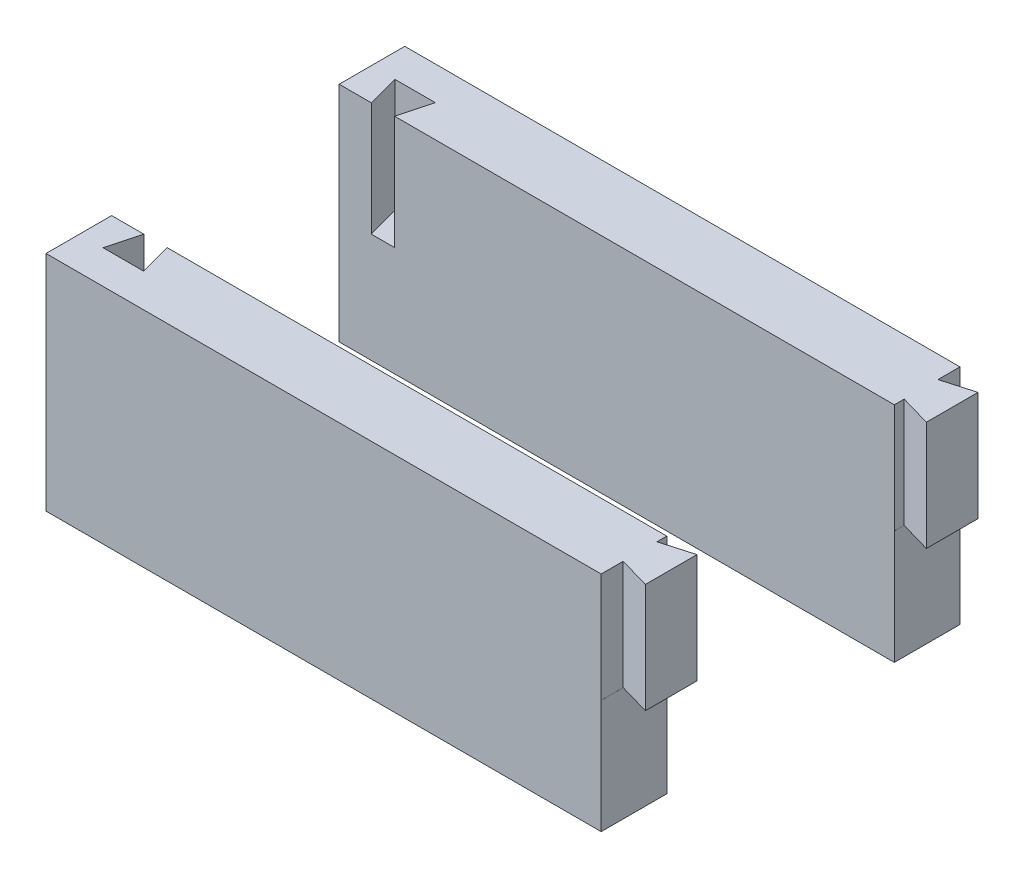
ISO-10303-21;
HEADER;
FILE_DESCRIPTION(('STEP AP214'),'2;1');
FILE_NAME('part.step','',(''),(''),'','','');
FILE_SCHEMA(('AUTOMOTIVE_DESIGN { 1 0 10303 214 1 1 1 1 }'));
ENDSEC;
DATA;
#1=APPLICATION_CONTEXT('core data for automotive mechanical design processes');
#2=APPLICATION_PROTOCOL_DEFINITION('international standard','automotive_design',2000,#1);
#3=PRODUCT_CONTEXT('',#1,'mechanical');
#4=PRODUCT('Part','Part','',(#3));
#5=PRODUCT_RELATED_PRODUCT_CATEGORY('part','',(#4));
#6=PRODUCT_DEFINITION_FORMATION('','',#4);
#7=PRODUCT_DEFINITION_CONTEXT('part definition',#1,'design');
#8=PRODUCT_DEFINITION('design','',#6,#7);
#9=PRODUCT_DEFINITION_SHAPE('','',#8);
#10=(LENGTH_UNIT() NAMED_UNIT(*) SI_UNIT(.MILLI.,.METRE.));
#11=(NAMED_UNIT(*) PLANE_ANGLE_UNIT() SI_UNIT($,.RADIAN.));
#12=(NAMED_UNIT(*) SI_UNIT($,.STERADIAN.) SOLID_ANGLE_UNIT());
#13=UNCERTAINTY_MEASURE_WITH_UNIT(LENGTH_MEASURE(1.E-05),#10,'distance_accuracy_value','');
#14=(GEOMETRIC_REPRESENTATION_CONTEXT(3) GLOBAL_UNCERTAINTY_ASSIGNED_CONTEXT((#13)) GLOBAL_UNIT_ASSIGNED_CONTEXT((#10,
#11,#12)) REPRESENTATION_CONTEXT('',''));
#15=CARTESIAN_POINT('',(0.,0.,0.));
#16=DIRECTION('',(0.,0.,1.));
#17=DIRECTION('',(1.,0.,0.));
#18=AXIS2_PLACEMENT_3D('',#15,#16,#17);
#19=CARTESIAN_POINT('',(-60.9366197183099,28.612676056338,-67.));
#20=DIRECTION('',(1.,0.,0.));
#21=DIRECTION('',(0.,0.,1.));
#22=AXIS2_PLACEMENT_3D('',#19,#20,#21);
#23=PLANE('',#22);
#24=DIRECTION('',(0.,-1.,0.));
#25=VECTOR('',#24,1.);
#26=CARTESIAN_POINT('',(-60.9366197183099,28.612676056338,-52.));
#27=LINE('',#26,#25);
#28=CARTESIAN_POINT('',(-60.9366197183099,28.612676056338,-52.));
#29=VERTEX_POINT('',#28);
#30=CARTESIAN_POINT('',(-60.9366197183099,-22.387323943662,-52.));
#31=VERTEX_POINT('',#30);
#32=EDGE_CURVE('E283',#29,#31,#27,.T.);
#33=ORIENTED_EDGE('',*,*,#32,.F.);
#34=DIRECTION('',(0.,0.,1.));
#35=VECTOR('',#34,1.);
#36=CARTESIAN_POINT('',(-60.9366197183099,28.612676056338,-67.));
#37=LINE('',#36,#35);
#38=CARTESIAN_POINT('',(-60.9366197183099,28.612676056338,-67.));
#39=VERTEX_POINT('',#38);
#40=EDGE_CURVE('E299',#39,#29,#37,.T.);
#41=ORIENTED_EDGE('',*,*,#40,.F.);
#42=DIRECTION('',(0.,-1.,0.));
#43=VECTOR('',#42,1.);
#44=CARTESIAN_POINT('',(-60.9366197183099,28.612676056338,-67.));
#45=LINE('',#44,#43);
#46=CARTESIAN_POINT('',(-60.9366197183099,-22.387323943662,-67.));
#47=VERTEX_POINT('',#46);
#48=EDGE_CURVE('E287',#39,#47,#45,.T.);
#49=ORIENTED_EDGE('',*,*,#48,.T.);
#50=DIRECTION('',(0.,0.,1.));
#51=VECTOR('',#50,1.);
#52=CARTESIAN_POINT('',(-60.9366197183099,-22.387323943662,-67.));
#53=LINE('',#52,#51);
#54=EDGE_CURVE('E12',#47,#31,#53,.T.);
#55=ORIENTED_EDGE('',*,*,#54,.T.);
#56=EDGE_LOOP('',(#33,#41,#49,#55));
#57=FACE_BOUND('',#56,.T.);
#58=ADVANCED_FACE('F54',(#57),#23,.F.);
#59=CARTESIAN_POINT('',(-60.9366197183099,-22.387323943662,-67.));
#60=DIRECTION('',(0.,1.,0.));
#61=DIRECTION('',(0.,0.,-1.));
#62=AXIS2_PLACEMENT_3D('',#59,#60,#61);
#63=PLANE('',#62);
#64=DIRECTION('',(1.,0.,0.));
#65=VECTOR('',#64,1.);
#66=CARTESIAN_POINT('',(-60.9366197183099,-22.387323943662,-52.));
#67=LINE('',#66,#65);
#68=CARTESIAN_POINT('',(65.9533802816901,-22.387323943662,-52.));
#69=VERTEX_POINT('',#68);
#70=EDGE_CURVE('E179',#31,#69,#67,.T.);
#71=ORIENTED_EDGE('',*,*,#70,.F.);
#72=ORIENTED_EDGE('',*,*,#54,.F.);
#73=DIRECTION('',(1.,0.,0.));
#74=VECTOR('',#73,1.);
#75=CARTESIAN_POINT('',(-60.9366197183099,-22.387323943662,-67.));
#76=LINE('',#75,#74);
#77=CARTESIAN_POINT('',(65.9533802816901,-22.387323943662,-67.));
#78=VERTEX_POINT('',#77);
#79=EDGE_CURVE('E291',#47,#78,#76,.T.);
#80=ORIENTED_EDGE('',*,*,#79,.T.);
#81=DIRECTION('',(0.,0.,1.));
#82=VECTOR('',#81,1.);
#83=CARTESIAN_POINT('',(65.9533802816901,-22.387323943662,-52.));
#84=LINE('',#83,#82);
#85=EDGE_CURVE('E170',#78,#69,#84,.T.);
#86=ORIENTED_EDGE('',*,*,#85,.T.);
#87=EDGE_LOOP('',(#71,#72,#80,#86));
#88=FACE_BOUND('',#87,.T.);
#89=ADVANCED_FACE('F359',(#88),#63,.F.);
#90=CARTESIAN_POINT('',(73.0633802816902,28.612676056338,-67.));
#91=DIRECTION('',(-1.,0.,0.));
#92=DIRECTION('',(0.,0.,-1.));
#93=AXIS2_PLACEMENT_3D('',#90,#91,#92);
#94=PLANE('',#93);
#95=DIRECTION('',(0.,1.,0.));
#96=VECTOR('',#95,1.);
#97=CARTESIAN_POINT('',(73.0633802816902,3.61267605633802,-64.0102835669542));
#98=LINE('',#97,#96);
#99=CARTESIAN_POINT('',(73.0633802816902,3.61267605633802,-64.0102835669542));
#100=VERTEX_POINT('',#99);
#101=CARTESIAN_POINT('',(73.0633802816902,28.612676056338,-64.0102835669542));
#102=VERTEX_POINT('',#101);
#103=EDGE_CURVE('E215',#100,#102,#98,.T.);
#104=ORIENTED_EDGE('',*,*,#103,.T.);
#105=DIRECTION('',(0.,0.,1.));
#106=VECTOR('',#105,1.);
#107=CARTESIAN_POINT('',(73.0633802816902,28.612676056338,-67.));
#108=LINE('',#107,#106);
#109=CARTESIAN_POINT('',(73.0633802816902,28.612676056338,-52.2102835669542));
#110=VERTEX_POINT('',#109);
#111=EDGE_CURVE('E62',#102,#110,#108,.T.);
#112=ORIENTED_EDGE('',*,*,#111,.T.);
#113=DIRECTION('',(0.,1.,0.));
#114=VECTOR('',#113,1.);
#115=CARTESIAN_POINT('',(73.0633802816902,3.61267605633802,-52.2102835669542));
#116=LINE('',#115,#114);
#117=CARTESIAN_POINT('',(73.0633802816902,3.61267605633802,-52.2102835669542));
#118=VERTEX_POINT('',#117);
#119=EDGE_CURVE('E194',#118,#110,#116,.T.);
#120=ORIENTED_EDGE('',*,*,#119,.F.);
#121=DIRECTION('',(0.,0.,-1.));
#122=VECTOR('',#121,1.);
#123=CARTESIAN_POINT('',(73.0633802816902,3.61267605633802,-52.));
#124=LINE('',#123,#122);
#125=EDGE_CURVE('E182',#118,#100,#124,.T.);
#126=ORIENTED_EDGE('',*,*,#125,.T.);
#127=EDGE_LOOP('',(#104,#112,#120,#126));
#128=FACE_BOUND('',#127,.T.);
#129=ADVANCED_FACE('F315',(#128),#94,.F.);
#130=CARTESIAN_POINT('',(-60.9366197183099,28.612676056338,-67.));
#131=DIRECTION('',(0.,-1.,0.));
#132=DIRECTION('',(0.,0.,1.));
#133=AXIS2_PLACEMENT_3D('',#130,#131,#132);
#134=PLANE('',#133);
#135=DIRECTION('',(0.961261695938317,0.,0.275637355817005));
#136=VECTOR('',#135,1.);
#137=CARTESIAN_POINT('',(73.0633802816902,28.612676056338,-52.2102835669542));
#138=LINE('',#137,#136);
#139=CARTESIAN_POINT('',(65.9500437317466,28.612676056338,-54.25));
#140=VERTEX_POINT('',#139);
#141=EDGE_CURVE('E204',#140,#110,#138,.T.);
#142=ORIENTED_EDGE('',*,*,#141,.T.);
#143=ORIENTED_EDGE('',*,*,#111,.F.);
#144=DIRECTION('',(-0.961261695938318,0.,0.275637355817004));
#145=VECTOR('',#144,1.);
#146=CARTESIAN_POINT('',(65.9500437317466,28.612676056338,-61.9705671339084));
#147=LINE('',#146,#145);
#148=CARTESIAN_POINT('',(65.9500437317466,28.612676056338,-61.9705671339084));
#149=VERTEX_POINT('',#148);
#150=EDGE_CURVE('E205',#102,#149,#147,.T.);
#151=ORIENTED_EDGE('',*,*,#150,.T.);
#152=DIRECTION('',(0.,0.,-1.));
#153=VECTOR('',#152,1.);
#154=CARTESIAN_POINT('',(65.9500437317466,28.612676056338,-67.));
#155=LINE('',#154,#153);
#156=CARTESIAN_POINT('',(65.9500437317466,28.612676056338,-67.));
#157=VERTEX_POINT('',#156);
#158=EDGE_CURVE('E226',#149,#157,#155,.T.);
#159=ORIENTED_EDGE('',*,*,#158,.T.);
#160=DIRECTION('',(-1.,0.,0.));
#161=VECTOR('',#160,1.);
#162=CARTESIAN_POINT('',(-60.9366197183099,28.612676056338,-67.));
#163=LINE('',#162,#161);
#164=EDGE_CURVE('E296',#157,#39,#163,.T.);
#165=ORIENTED_EDGE('',*,*,#164,.T.);
#166=ORIENTED_EDGE('',*,*,#40,.T.);
#167=DIRECTION('',(-1.,0.,0.));
#168=VECTOR('',#167,1.);
#169=CARTESIAN_POINT('',(-60.9366197183099,28.612676056338,-52.));
#170=LINE('',#169,#168);
#171=CARTESIAN_POINT('',(-53.5866197183098,28.6126760563381,-52.));
#172=VERTEX_POINT('',#171);
#173=EDGE_CURVE('E304',#172,#29,#170,.T.);
#174=ORIENTED_EDGE('',*,*,#173,.F.);
#175=DIRECTION('',(0.258819045102518,0.,0.965925826289069));
#176=VECTOR('',#175,1.);
#177=CARTESIAN_POINT('',(-53.5866197183098,28.612676056338,-52.));
#178=LINE('',#177,#176);
#179=CARTESIAN_POINT('',(-55.553644461089,28.6126760563381,-59.3410362797969));
#180=VERTEX_POINT('',#179);
#181=EDGE_CURVE('E253',#180,#172,#178,.T.);
#182=ORIENTED_EDGE('',*,*,#181,.F.);
#183=DIRECTION('',(-1.,0.,0.));
#184=VECTOR('',#183,1.);
#185=CARTESIAN_POINT('',(-55.553644461089,28.612676056338,-59.3410362797969));
#186=LINE('',#185,#184);
#187=CARTESIAN_POINT('',(-46.3195949755307,28.6126760563381,-59.3410362797969));
#188=VERTEX_POINT('',#187);
#189=EDGE_CURVE('E261',#188,#180,#186,.T.);
#190=ORIENTED_EDGE('',*,*,#189,.F.);
#191=DIRECTION('',(0.258819045102518,0.,-0.965925826289069));
#192=VECTOR('',#191,1.);
#193=CARTESIAN_POINT('',(-46.3195949755307,28.612676056338,-59.3410362797969));
#194=LINE('',#193,#192);
#195=CARTESIAN_POINT('',(-48.2866197183099,28.6126760563381,-52.));
#196=VERTEX_POINT('',#195);
#197=EDGE_CURVE('E257',#196,#188,#194,.T.);
#198=ORIENTED_EDGE('',*,*,#197,.F.);
#199=CARTESIAN_POINT('',(65.9500437317466,28.612676056338,-52.));
#200=VERTEX_POINT('',#199);
#201=EDGE_CURVE('E292',#200,#196,#170,.T.);
#202=ORIENTED_EDGE('',*,*,#201,.F.);
#203=DIRECTION('',(0.,0.,-1.));
#204=VECTOR('',#203,1.);
#205=CARTESIAN_POINT('',(65.9500437317466,28.612676056338,-54.25));
#206=LINE('',#205,#204);
#207=EDGE_CURVE('E200',#200,#140,#206,.T.);
#208=ORIENTED_EDGE('',*,*,#207,.T.);
#209=EDGE_LOOP('',(#142,#143,#151,#159,#165,#166,#174,#182,#190,#198,#202,#208));
#210=FACE_BOUND('',#209,.T.);
#211=ADVANCED_FACE('F319',(#210),#134,.F.);
#212=CARTESIAN_POINT('',(0.,0.,-67.));
#213=DIRECTION('',(0.,0.,-1.));
#214=DIRECTION('',(1.,0.,0.));
#215=AXIS2_PLACEMENT_3D('',#212,#213,#214);
#216=PLANE('',#215);
#217=DIRECTION('',(0.,-1.,0.));
#218=VECTOR('',#217,1.);
#219=CARTESIAN_POINT('',(65.9533802816901,3.61267605633802,-67.));
#220=LINE('',#219,#218);
#221=CARTESIAN_POINT('',(65.9533802816901,3.61267605633802,-67.));
#222=VERTEX_POINT('',#221);
#223=EDGE_CURVE('E181',#222,#78,#220,.T.);
#224=ORIENTED_EDGE('',*,*,#223,.T.);
#225=ORIENTED_EDGE('',*,*,#79,.F.);
#226=ORIENTED_EDGE('',*,*,#48,.F.);
#227=ORIENTED_EDGE('',*,*,#164,.F.);
#228=DIRECTION('',(0.,1.,0.));
#229=VECTOR('',#228,1.);
#230=CARTESIAN_POINT('',(65.9500437317466,3.61267605633802,-67.));
#231=LINE('',#230,#229);
#232=CARTESIAN_POINT('',(65.9500437317466,3.61267605633802,-67.));
#233=VERTEX_POINT('',#232);
#234=EDGE_CURVE('E222',#233,#157,#231,.T.);
#235=ORIENTED_EDGE('',*,*,#234,.F.);
#236=DIRECTION('',(1.,0.,0.));
#237=VECTOR('',#236,1.);
#238=CARTESIAN_POINT('',(73.0633802816902,3.61267605633802,-67.));
#239=LINE('',#238,#237);
#240=EDGE_CURVE('E230',#233,#222,#239,.T.);
#241=ORIENTED_EDGE('',*,*,#240,.T.);
#242=EDGE_LOOP('',(#224,#225,#226,#227,#235,#241));
#243=FACE_BOUND('',#242,.T.);
#244=ADVANCED_FACE('F363',(#243),#216,.T.);
#245=CARTESIAN_POINT('',(0.,0.,-52.));
#246=DIRECTION('',(0.,0.,-1.));
#247=DIRECTION('',(1.,0.,0.));
#248=AXIS2_PLACEMENT_3D('',#245,#246,#247);
#249=PLANE('',#248);
#250=DIRECTION('',(-1.,0.,0.));
#251=VECTOR('',#250,1.);
#252=CARTESIAN_POINT('',(65.9500437317466,3.61267605633802,-52.));
#253=LINE('',#252,#251);
#254=CARTESIAN_POINT('',(65.9533802816901,3.61267605633802,-52.));
#255=VERTEX_POINT('',#254);
#256=CARTESIAN_POINT('',(65.9500437317466,3.61267605633802,-52.));
#257=VERTEX_POINT('',#256);
#258=EDGE_CURVE('E177',#255,#257,#253,.T.);
#259=ORIENTED_EDGE('',*,*,#258,.T.);
#260=DIRECTION('',(0.,1.,0.));
#261=VECTOR('',#260,1.);
#262=CARTESIAN_POINT('',(65.9500437317466,3.61267605633802,-52.));
#263=LINE('',#262,#261);
#264=EDGE_CURVE('E208',#257,#200,#263,.T.);
#265=ORIENTED_EDGE('',*,*,#264,.T.);
#266=ORIENTED_EDGE('',*,*,#201,.T.);
#267=DIRECTION('',(0.,-1.,0.));
#268=VECTOR('',#267,1.);
#269=CARTESIAN_POINT('',(-48.2866197183099,272.562218231117,-52.));
#270=LINE('',#269,#268);
#271=CARTESIAN_POINT('',(-48.2866197183099,2.61267605633802,-52.));
#272=VERTEX_POINT('',#271);
#273=EDGE_CURVE('E275',#196,#272,#270,.T.);
#274=ORIENTED_EDGE('',*,*,#273,.T.);
#275=DIRECTION('',(-1.,0.,0.));
#276=VECTOR('',#275,1.);
#277=CARTESIAN_POINT('',(-60.9366197183099,2.61267605633802,-52.));
#278=LINE('',#277,#276);
#279=CARTESIAN_POINT('',(-53.5866197183098,2.61267605633808,-52.));
#280=VERTEX_POINT('',#279);
#281=EDGE_CURVE('E211',#272,#280,#278,.T.);
#282=ORIENTED_EDGE('',*,*,#281,.T.);
#283=DIRECTION('',(0.,-1.,0.));
#284=VECTOR('',#283,1.);
#285=CARTESIAN_POINT('',(-53.5866197183098,272.562218231117,-52.));
#286=LINE('',#285,#284);
#287=EDGE_CURVE('E248',#172,#280,#286,.T.);
#288=ORIENTED_EDGE('',*,*,#287,.F.);
#289=ORIENTED_EDGE('',*,*,#173,.T.);
#290=ORIENTED_EDGE('',*,*,#32,.T.);
#291=ORIENTED_EDGE('',*,*,#70,.T.);
#292=DIRECTION('',(0.,-1.,0.));
#293=VECTOR('',#292,1.);
#294=CARTESIAN_POINT('',(65.9533802816901,3.61267605633802,-52.));
#295=LINE('',#294,#293);
#296=EDGE_CURVE('E165',#255,#69,#295,.T.);
#297=ORIENTED_EDGE('',*,*,#296,.F.);
#298=EDGE_LOOP('',(#259,#265,#266,#274,#282,#288,#289,#290,#291,#297));
#299=FACE_BOUND('',#298,.T.);
#300=ADVANCED_FACE('F176',(#299),#249,.F.);
#301=CARTESIAN_POINT('',(-46.3195949755307,272.562218231117,-59.3410362797969));
#302=DIRECTION('',(-0.965925826289069,0.,-0.258819045102518));
#303=DIRECTION('',(0.258819045102518,0.,-0.965925826289069));
#304=AXIS2_PLACEMENT_3D('',#301,#302,#303);
#305=PLANE('',#304);
#306=ORIENTED_EDGE('',*,*,#197,.T.);
#307=DIRECTION('',(0.,-1.,0.));
#308=VECTOR('',#307,1.);
#309=CARTESIAN_POINT('',(-46.3195949755307,272.562218231117,-59.3410362797969));
#310=LINE('',#309,#308);
#311=CARTESIAN_POINT('',(-46.3195949755307,2.61267605633808,-59.3410362797969));
#312=VERTEX_POINT('',#311);
#313=EDGE_CURVE('E279',#188,#312,#310,.T.);
#314=ORIENTED_EDGE('',*,*,#313,.T.);
#315=DIRECTION('',(0.258819045102518,0.,-0.965925826289069));
#316=VECTOR('',#315,1.);
#317=CARTESIAN_POINT('',(-46.3195949755307,2.61267605633803,-59.3410362797969));
#318=LINE('',#317,#316);
#319=EDGE_CURVE('E244',#272,#312,#318,.T.);
#320=ORIENTED_EDGE('',*,*,#319,.F.);
#321=ORIENTED_EDGE('',*,*,#273,.F.);
#322=EDGE_LOOP('',(#306,#314,#320,#321));
#323=FACE_BOUND('',#322,.T.);
#324=ADVANCED_FACE('F344',(#323),#305,.T.);
#325=CARTESIAN_POINT('',(-55.553644461089,272.562218231117,-59.3410362797969));
#326=DIRECTION('',(0.,0.,1.));
#327=DIRECTION('',(-1.,0.,0.));
#328=AXIS2_PLACEMENT_3D('',#325,#326,#327);
#329=PLANE('',#328);
#330=ORIENTED_EDGE('',*,*,#189,.T.);
#331=DIRECTION('',(0.,-1.,0.));
#332=VECTOR('',#331,1.);
#333=CARTESIAN_POINT('',(-55.553644461089,272.562218231117,-59.3410362797969));
#334=LINE('',#333,#332);
#335=CARTESIAN_POINT('',(-55.553644461089,2.61267605633808,-59.3410362797969));
#336=VERTEX_POINT('',#335);
#337=EDGE_CURVE('E271',#180,#336,#334,.T.);
#338=ORIENTED_EDGE('',*,*,#337,.T.);
#339=DIRECTION('',(-1.,0.,0.));
#340=VECTOR('',#339,1.);
#341=CARTESIAN_POINT('',(-55.553644461089,2.61267605633803,-59.3410362797969));
#342=LINE('',#341,#340);
#343=EDGE_CURVE('E249',#312,#336,#342,.T.);
#344=ORIENTED_EDGE('',*,*,#343,.F.);
#345=ORIENTED_EDGE('',*,*,#313,.F.);
#346=EDGE_LOOP('',(#330,#338,#344,#345));
#347=FACE_BOUND('',#346,.T.);
#348=ADVANCED_FACE('F400',(#347),#329,.T.);
#349=CARTESIAN_POINT('',(-53.5866197183098,272.562218231117,-52.));
#350=DIRECTION('',(0.965925826289069,0.,-0.258819045102518));
#351=DIRECTION('',(0.258819045102518,0.,0.965925826289069));
#352=AXIS2_PLACEMENT_3D('',#349,#350,#351);
#353=PLANE('',#352);
#354=ORIENTED_EDGE('',*,*,#181,.T.);
#355=ORIENTED_EDGE('',*,*,#287,.T.);
#356=DIRECTION('',(0.258819045102518,0.,0.965925826289069));
#357=VECTOR('',#356,1.);
#358=CARTESIAN_POINT('',(-53.5866197183098,2.61267605633803,-52.));
#359=LINE('',#358,#357);
#360=EDGE_CURVE('E250',#336,#280,#359,.T.);
#361=ORIENTED_EDGE('',*,*,#360,.F.);
#362=ORIENTED_EDGE('',*,*,#337,.F.);
#363=EDGE_LOOP('',(#354,#355,#361,#362));
#364=FACE_BOUND('',#363,.T.);
#365=ADVANCED_FACE('F350',(#364),#353,.T.);
#366=CARTESIAN_POINT('',(-60.9366197183099,2.61267605633802,-67.));
#367=DIRECTION('',(0.,-1.,0.));
#368=DIRECTION('',(0.,0.,1.));
#369=AXIS2_PLACEMENT_3D('',#366,#367,#368);
#370=PLANE('',#369);
#371=ORIENTED_EDGE('',*,*,#281,.F.);
#372=ORIENTED_EDGE('',*,*,#319,.T.);
#373=ORIENTED_EDGE('',*,*,#343,.T.);
#374=ORIENTED_EDGE('',*,*,#360,.T.);
#375=EDGE_LOOP('',(#371,#372,#373,#374));
#376=FACE_BOUND('',#375,.T.);
#377=ADVANCED_FACE('F347',(#376),#370,.F.);
#378=CARTESIAN_POINT('',(65.9500437317466,3.61267605633802,-54.25));
#379=DIRECTION('',(-1.,0.,0.));
#380=DIRECTION('',(0.,0.,-1.));
#381=AXIS2_PLACEMENT_3D('',#378,#379,#380);
#382=PLANE('',#381);
#383=ORIENTED_EDGE('',*,*,#207,.F.);
#384=ORIENTED_EDGE('',*,*,#264,.F.);
#385=DIRECTION('',(0.,0.,-1.));
#386=VECTOR('',#385,1.);
#387=CARTESIAN_POINT('',(65.9500437317466,3.61267605633802,-54.25));
#388=LINE('',#387,#386);
#389=CARTESIAN_POINT('',(65.9500437317466,3.61267605633802,-54.25));
#390=VERTEX_POINT('',#389);
#391=EDGE_CURVE('E186',#257,#390,#388,.T.);
#392=ORIENTED_EDGE('',*,*,#391,.T.);
#393=DIRECTION('',(0.,1.,0.));
#394=VECTOR('',#393,1.);
#395=CARTESIAN_POINT('',(65.9500437317466,3.61267605633802,-54.25));
#396=LINE('',#395,#394);
#397=EDGE_CURVE('E189',#390,#140,#396,.T.);
#398=ORIENTED_EDGE('',*,*,#397,.T.);
#399=EDGE_LOOP('',(#383,#384,#392,#398));
#400=FACE_BOUND('',#399,.T.);
#401=ADVANCED_FACE('F339',(#400),#382,.F.);
#402=CARTESIAN_POINT('',(73.0633802816902,3.61267605633802,-52.2102835669542));
#403=DIRECTION('',(0.275637355817005,0.,-0.961261695938317));
#404=DIRECTION('',(0.961261695938317,0.,0.275637355817005));
#405=AXIS2_PLACEMENT_3D('',#402,#403,#404);
#406=PLANE('',#405);
#407=ORIENTED_EDGE('',*,*,#141,.F.);
#408=ORIENTED_EDGE('',*,*,#397,.F.);
#409=DIRECTION('',(0.961261695938317,0.,0.275637355817005));
#410=VECTOR('',#409,1.);
#411=CARTESIAN_POINT('',(73.0633802816902,3.61267605633802,-52.2102835669542));
#412=LINE('',#411,#410);
#413=CARTESIAN_POINT('',(65.9533802816901,3.61267605633802,-54.2490432596993));
#414=VERTEX_POINT('',#413);
#415=EDGE_CURVE('E190',#390,#414,#412,.T.);
#416=ORIENTED_EDGE('',*,*,#415,.T.);
#417=DIRECTION('',(-0.961261695938317,0.,-0.275637355817005));
#418=VECTOR('',#417,1.);
#419=CARTESIAN_POINT('',(73.0633802816902,3.61267605633802,-52.2102835669542));
#420=LINE('',#419,#418);
#421=EDGE_CURVE('E225',#118,#414,#420,.T.);
#422=ORIENTED_EDGE('',*,*,#421,.F.);
#423=ORIENTED_EDGE('',*,*,#119,.T.);
#424=EDGE_LOOP('',(#407,#408,#416,#422,#423));
#425=FACE_BOUND('',#424,.T.);
#426=ADVANCED_FACE('F325',(#425),#406,.F.);
#427=CARTESIAN_POINT('',(0.,3.61267605633802,-52.));
#428=DIRECTION('',(0.,-1.,0.));
#429=DIRECTION('',(0.,0.,1.));
#430=AXIS2_PLACEMENT_3D('',#427,#428,#429);
#431=PLANE('',#430);
#432=ORIENTED_EDGE('',*,*,#415,.F.);
#433=ORIENTED_EDGE('',*,*,#391,.F.);
#434=ORIENTED_EDGE('',*,*,#258,.F.);
#435=DIRECTION('',(0.,0.,1.));
#436=VECTOR('',#435,1.);
#437=CARTESIAN_POINT('',(65.9533802816901,3.61267605633802,-52.));
#438=LINE('',#437,#436);
#439=EDGE_CURVE('E161',#414,#255,#438,.T.);
#440=ORIENTED_EDGE('',*,*,#439,.F.);
#441=EDGE_LOOP('',(#432,#433,#434,#440));
#442=FACE_BOUND('',#441,.T.);
#443=ADVANCED_FACE('F184',(#442),#431,.F.);
#444=CARTESIAN_POINT('',(65.9500437317466,3.61267605633802,-67.));
#445=DIRECTION('',(-1.,0.,0.));
#446=DIRECTION('',(0.,0.,-1.));
#447=AXIS2_PLACEMENT_3D('',#444,#445,#446);
#448=PLANE('',#447);
#449=ORIENTED_EDGE('',*,*,#158,.F.);
#450=DIRECTION('',(0.,1.,0.));
#451=VECTOR('',#450,1.);
#452=CARTESIAN_POINT('',(65.9500437317466,3.61267605633802,-61.9705671339084));
#453=LINE('',#452,#451);
#454=CARTESIAN_POINT('',(65.9500437317466,3.61267605633802,-61.9705671339084));
#455=VERTEX_POINT('',#454);
#456=EDGE_CURVE('E219',#455,#149,#453,.T.);
#457=ORIENTED_EDGE('',*,*,#456,.F.);
#458=DIRECTION('',(0.,0.,-1.));
#459=VECTOR('',#458,1.);
#460=CARTESIAN_POINT('',(65.9500437317466,3.61267605633802,-67.));
#461=LINE('',#460,#459);
#462=EDGE_CURVE('E77',#455,#233,#461,.T.);
#463=ORIENTED_EDGE('',*,*,#462,.T.);
#464=ORIENTED_EDGE('',*,*,#234,.T.);
#465=EDGE_LOOP('',(#449,#457,#463,#464));
#466=FACE_BOUND('',#465,.T.);
#467=ADVANCED_FACE('F371',(#466),#448,.F.);
#468=CARTESIAN_POINT('',(65.9500437317466,3.61267605633802,-61.9705671339084));
#469=DIRECTION('',(0.275637355817004,0.,0.961261695938318));
#470=DIRECTION('',(-0.961261695938318,0.,0.275637355817004));
#471=AXIS2_PLACEMENT_3D('',#468,#469,#470);
#472=PLANE('',#471);
#473=ORIENTED_EDGE('',*,*,#150,.F.);
#474=ORIENTED_EDGE('',*,*,#103,.F.);
#475=DIRECTION('',(-0.961261695938318,0.,0.275637355817004));
#476=VECTOR('',#475,1.);
#477=CARTESIAN_POINT('',(65.9500437317466,3.61267605633802,-61.9705671339084));
#478=LINE('',#477,#476);
#479=CARTESIAN_POINT('',(65.9533802816901,3.61267605633802,-61.971523874209));
#480=VERTEX_POINT('',#479);
#481=EDGE_CURVE('E237',#100,#480,#478,.T.);
#482=ORIENTED_EDGE('',*,*,#481,.T.);
#483=EDGE_CURVE('E236',#480,#455,#478,.T.);
#484=ORIENTED_EDGE('',*,*,#483,.T.);
#485=ORIENTED_EDGE('',*,*,#456,.T.);
#486=EDGE_LOOP('',(#473,#474,#482,#484,#485));
#487=FACE_BOUND('',#486,.T.);
#488=ADVANCED_FACE('F369',(#487),#472,.F.);
#489=CARTESIAN_POINT('',(0.,3.61267605633802,-52.));
#490=DIRECTION('',(0.,-1.,0.));
#491=DIRECTION('',(0.,0.,1.));
#492=AXIS2_PLACEMENT_3D('',#489,#490,#491);
#493=PLANE('',#492);
#494=ORIENTED_EDGE('',*,*,#240,.F.);
#495=ORIENTED_EDGE('',*,*,#462,.F.);
#496=ORIENTED_EDGE('',*,*,#483,.F.);
#497=EDGE_CURVE('E172',#222,#480,#438,.T.);
#498=ORIENTED_EDGE('',*,*,#497,.F.);
#499=EDGE_LOOP('',(#494,#495,#496,#498));
#500=FACE_BOUND('',#499,.T.);
#501=ADVANCED_FACE('F366',(#500),#493,.F.);
#502=CARTESIAN_POINT('',(0.,3.61267605633802,-52.));
#503=DIRECTION('',(0.,1.,0.));
#504=DIRECTION('',(0.,0.,-1.));
#505=AXIS2_PLACEMENT_3D('',#502,#503,#504);
#506=PLANE('',#505);
#507=ORIENTED_EDGE('',*,*,#125,.F.);
#508=ORIENTED_EDGE('',*,*,#421,.T.);
#509=EDGE_CURVE('E69',#480,#414,#438,.T.);
#510=ORIENTED_EDGE('',*,*,#509,.F.);
#511=ORIENTED_EDGE('',*,*,#481,.F.);
#512=EDGE_LOOP('',(#507,#508,#510,#511));
#513=FACE_BOUND('',#512,.T.);
#514=ADVANCED_FACE('F329',(#513),#506,.F.);
#515=CARTESIAN_POINT('',(65.9533802816901,3.61267605633802,-52.));
#516=DIRECTION('',(-1.,0.,0.));
#517=DIRECTION('',(0.,0.,-1.));
#518=AXIS2_PLACEMENT_3D('',#515,#516,#517);
#519=PLANE('',#518);
#520=ORIENTED_EDGE('',*,*,#85,.F.);
#521=ORIENTED_EDGE('',*,*,#223,.F.);
#522=ORIENTED_EDGE('',*,*,#497,.T.);
#523=ORIENTED_EDGE('',*,*,#509,.T.);
#524=ORIENTED_EDGE('',*,*,#439,.T.);
#525=ORIENTED_EDGE('',*,*,#296,.T.);
#526=EDGE_LOOP('',(#520,#521,#522,#523,#524,#525));
#527=FACE_BOUND('',#526,.T.);
#528=ADVANCED_FACE('F164',(#527),#519,.F.);
#529=CLOSED_SHELL('',(#58,#89,#129,#211,#244,#300,#324,#348,#365,#377,#401,#426,#443,#467,#488,
#501,#514,#528));
#530=MANIFOLD_SOLID_BREP('B2',#529);
#531=CARTESIAN_POINT('',(-60.9366197183099,28.612676056338,15.));
#532=DIRECTION('',(1.,0.,0.));
#533=DIRECTION('',(0.,0.,-1.));
#534=AXIS2_PLACEMENT_3D('',#531,#532,#533);
#535=PLANE('',#534);
#536=DIRECTION('',(0.,-1.,0.));
#537=VECTOR('',#536,1.);
#538=CARTESIAN_POINT('',(-60.9366197183099,28.612676056338,0.));
#539=LINE('',#538,#537);
#540=CARTESIAN_POINT('',(-60.9366197183099,28.612676056338,0.));
#541=VERTEX_POINT('',#540);
#542=CARTESIAN_POINT('',(-60.9366197183099,-22.387323943662,0.));
#543=VERTEX_POINT('',#542);
#544=EDGE_CURVE('E774',#541,#543,#539,.T.);
#545=ORIENTED_EDGE('',*,*,#544,.T.);
#546=DIRECTION('',(0.,0.,-1.));
#547=VECTOR('',#546,1.);
#548=CARTESIAN_POINT('',(-60.9366197183099,-22.387323943662,15.));
#549=LINE('',#548,#547);
#550=CARTESIAN_POINT('',(-60.9366197183099,-22.387323943662,15.));
#551=VERTEX_POINT('',#550);
#552=EDGE_CURVE('E52',#551,#543,#549,.T.);
#553=ORIENTED_EDGE('',*,*,#552,.F.);
#554=DIRECTION('',(0.,-1.,0.));
#555=VECTOR('',#554,1.);
#556=CARTESIAN_POINT('',(-60.9366197183099,28.612676056338,15.));
#557=LINE('',#556,#555);
#558=CARTESIAN_POINT('',(-60.9366197183099,28.612676056338,15.));
#559=VERTEX_POINT('',#558);
#560=EDGE_CURVE('E776',#559,#551,#557,.T.);
#561=ORIENTED_EDGE('',*,*,#560,.F.);
#562=DIRECTION('',(0.,0.,-1.));
#563=VECTOR('',#562,1.);
#564=CARTESIAN_POINT('',(-60.9366197183099,28.612676056338,15.));
#565=LINE('',#564,#563);
#566=EDGE_CURVE('E785',#559,#541,#565,.T.);
#567=ORIENTED_EDGE('',*,*,#566,.T.);
#568=EDGE_LOOP('',(#545,#553,#561,#567));
#569=FACE_BOUND('',#568,.T.);
#570=ADVANCED_FACE('F577',(#569),#535,.F.);
#571=CARTESIAN_POINT('',(-60.9366197183099,-22.387323943662,15.));
#572=DIRECTION('',(0.,1.,0.));
#573=DIRECTION('',(0.,0.,1.));
#574=AXIS2_PLACEMENT_3D('',#571,#572,#573);
#575=PLANE('',#574);
#576=DIRECTION('',(1.,0.,0.));
#577=VECTOR('',#576,1.);
#578=CARTESIAN_POINT('',(-60.9366197183099,-22.387323943662,0.));
#579=LINE('',#578,#577);
#580=CARTESIAN_POINT('',(65.9533802816901,-22.387323943662,0.));
#581=VERTEX_POINT('',#580);
#582=EDGE_CURVE('E787',#543,#581,#579,.T.);
#583=ORIENTED_EDGE('',*,*,#582,.T.);
#584=DIRECTION('',(0.,0.,-1.));
#585=VECTOR('',#584,1.);
#586=CARTESIAN_POINT('',(65.9533802816901,-22.387323943662,0.));
#587=LINE('',#586,#585);
#588=CARTESIAN_POINT('',(65.9533802816901,-22.387323943662,15.));
#589=VERTEX_POINT('',#588);
#590=EDGE_CURVE('E687',#589,#581,#587,.T.);
#591=ORIENTED_EDGE('',*,*,#590,.F.);
#592=DIRECTION('',(1.,0.,0.));
#593=VECTOR('',#592,1.);
#594=CARTESIAN_POINT('',(-60.9366197183099,-22.387323943662,15.));
#595=LINE('',#594,#593);
#596=EDGE_CURVE('E779',#551,#589,#595,.T.);
#597=ORIENTED_EDGE('',*,*,#596,.F.);
#598=ORIENTED_EDGE('',*,*,#552,.T.);
#599=EDGE_LOOP('',(#583,#591,#597,#598));
#600=FACE_BOUND('',#599,.T.);
#601=ADVANCED_FACE('F851',(#600),#575,.F.);
#602=CARTESIAN_POINT('',(73.0633802816902,28.612676056338,15.));
#603=DIRECTION('',(-1.,0.,0.));
#604=DIRECTION('',(0.,0.,1.));
#605=AXIS2_PLACEMENT_3D('',#602,#603,#604);
#606=PLANE('',#605);
#607=DIRECTION('',(0.,1.,0.));
#608=VECTOR('',#607,1.);
#609=CARTESIAN_POINT('',(73.0633802816902,3.61267605633802,12.0102835669542));
#610=LINE('',#609,#608);
#611=CARTESIAN_POINT('',(73.0633802816902,3.61267605633802,12.0102835669542));
#612=VERTEX_POINT('',#611);
#613=CARTESIAN_POINT('',(73.0633802816902,28.612676056338,12.0102835669542));
#614=VERTEX_POINT('',#613);
#615=EDGE_CURVE('E727',#612,#614,#610,.T.);
#616=ORIENTED_EDGE('',*,*,#615,.F.);
#617=DIRECTION('',(0.,0.,1.));
#618=VECTOR('',#617,1.);
#619=CARTESIAN_POINT('',(73.0633802816902,3.61267605633802,0.));
#620=LINE('',#619,#618);
#621=CARTESIAN_POINT('',(73.0633802816902,3.61267605633802,0.210283566954164));
#622=VERTEX_POINT('',#621);
#623=EDGE_CURVE('E693',#622,#612,#620,.T.);
#624=ORIENTED_EDGE('',*,*,#623,.F.);
#625=DIRECTION('',(0.,1.,0.));
#626=VECTOR('',#625,1.);
#627=CARTESIAN_POINT('',(73.0633802816902,3.61267605633802,0.210283566954164));
#628=LINE('',#627,#626);
#629=CARTESIAN_POINT('',(73.0633802816902,28.612676056338,0.210283566954164));
#630=VERTEX_POINT('',#629);
#631=EDGE_CURVE('E711',#622,#630,#628,.T.);
#632=ORIENTED_EDGE('',*,*,#631,.T.);
#633=DIRECTION('',(0.,0.,-1.));
#634=VECTOR('',#633,1.);
#635=CARTESIAN_POINT('',(73.0633802816902,28.612676056338,15.));
#636=LINE('',#635,#634);
#637=EDGE_CURVE('E584',#614,#630,#636,.T.);
#638=ORIENTED_EDGE('',*,*,#637,.F.);
#639=EDGE_LOOP('',(#616,#624,#632,#638));
#640=FACE_BOUND('',#639,.T.);
#641=ADVANCED_FACE('F802',(#640),#606,.F.);
#642=CARTESIAN_POINT('',(-60.9366197183099,28.612676056338,15.));
#643=DIRECTION('',(0.,-1.,0.));
#644=DIRECTION('',(0.,0.,-1.));
#645=AXIS2_PLACEMENT_3D('',#642,#643,#644);
#646=PLANE('',#645);
#647=DIRECTION('',(0.961261695938317,0.,-0.275637355817005));
#648=VECTOR('',#647,1.);
#649=CARTESIAN_POINT('',(73.0633802816902,28.612676056338,0.210283566954164));
#650=LINE('',#649,#648);
#651=CARTESIAN_POINT('',(65.9500437317466,28.612676056338,2.25));
#652=VERTEX_POINT('',#651);
#653=EDGE_CURVE('E720',#652,#630,#650,.T.);
#654=ORIENTED_EDGE('',*,*,#653,.F.);
#655=DIRECTION('',(0.,0.,1.));
#656=VECTOR('',#655,1.);
#657=CARTESIAN_POINT('',(65.9500437317466,28.612676056338,2.25));
#658=LINE('',#657,#656);
#659=CARTESIAN_POINT('',(65.9500437317466,28.612676056338,0.));
#660=VERTEX_POINT('',#659);
#661=EDGE_CURVE('E717',#660,#652,#658,.T.);
#662=ORIENTED_EDGE('',*,*,#661,.F.);
#663=DIRECTION('',(-1.,0.,0.));
#664=VECTOR('',#663,1.);
#665=CARTESIAN_POINT('',(-60.9366197183099,28.612676056338,0.));
#666=LINE('',#665,#664);
#667=CARTESIAN_POINT('',(-48.2866197183099,28.6126760563381,0.));
#668=VERTEX_POINT('',#667);
#669=EDGE_CURVE('E780',#660,#668,#666,.T.);
#670=ORIENTED_EDGE('',*,*,#669,.T.);
#671=DIRECTION('',(0.258819045102518,0.,0.965925826289069));
#672=VECTOR('',#671,1.);
#673=CARTESIAN_POINT('',(-46.3195949755307,28.612676056338,7.34103627979693));
#674=LINE('',#673,#672);
#675=CARTESIAN_POINT('',(-46.3195949755307,28.6126760563381,7.34103627979693));
#676=VERTEX_POINT('',#675);
#677=EDGE_CURVE('E756',#668,#676,#674,.T.);
#678=ORIENTED_EDGE('',*,*,#677,.T.);
#679=DIRECTION('',(-1.,0.,0.));
#680=VECTOR('',#679,1.);
#681=CARTESIAN_POINT('',(-55.553644461089,28.612676056338,7.34103627979693));
#682=LINE('',#681,#680);
#683=CARTESIAN_POINT('',(-55.553644461089,28.6126760563381,7.34103627979693));
#684=VERTEX_POINT('',#683);
#685=EDGE_CURVE('E759',#676,#684,#682,.T.);
#686=ORIENTED_EDGE('',*,*,#685,.T.);
#687=DIRECTION('',(0.258819045102518,0.,-0.965925826289069));
#688=VECTOR('',#687,1.);
#689=CARTESIAN_POINT('',(-53.5866197183098,28.612676056338,0.));
#690=LINE('',#689,#688);
#691=CARTESIAN_POINT('',(-53.5866197183098,28.6126760563381,0.));
#692=VERTEX_POINT('',#691);
#693=EDGE_CURVE('E753',#684,#692,#690,.T.);
#694=ORIENTED_EDGE('',*,*,#693,.T.);
#695=EDGE_CURVE('E789',#692,#541,#666,.T.);
#696=ORIENTED_EDGE('',*,*,#695,.T.);
#697=ORIENTED_EDGE('',*,*,#566,.F.);
#698=DIRECTION('',(-1.,0.,0.));
#699=VECTOR('',#698,1.);
#700=CARTESIAN_POINT('',(-60.9366197183099,28.612676056338,15.));
#701=LINE('',#700,#699);
#702=CARTESIAN_POINT('',(65.9500437317466,28.612676056338,15.));
#703=VERTEX_POINT('',#702);
#704=EDGE_CURVE('E783',#703,#559,#701,.T.);
#705=ORIENTED_EDGE('',*,*,#704,.F.);
#706=DIRECTION('',(0.,0.,1.));
#707=VECTOR('',#706,1.);
#708=CARTESIAN_POINT('',(65.9500437317466,28.612676056338,15.));
#709=LINE('',#708,#707);
#710=CARTESIAN_POINT('',(65.9500437317466,28.612676056338,9.97056713390836));
#711=VERTEX_POINT('',#710);
#712=EDGE_CURVE('E735',#711,#703,#709,.T.);
#713=ORIENTED_EDGE('',*,*,#712,.F.);
#714=DIRECTION('',(-0.961261695938318,0.,-0.275637355817004));
#715=VECTOR('',#714,1.);
#716=CARTESIAN_POINT('',(65.9500437317466,28.612676056338,9.97056713390836));
#717=LINE('',#716,#715);
#718=EDGE_CURVE('E721',#614,#711,#717,.T.);
#719=ORIENTED_EDGE('',*,*,#718,.F.);
#720=ORIENTED_EDGE('',*,*,#637,.T.);
#721=EDGE_LOOP('',(#654,#662,#670,#678,#686,#694,#696,#697,#705,#713,#719,#720));
#722=FACE_BOUND('',#721,.T.);
#723=ADVANCED_FACE('F797',(#722),#646,.F.);
#724=CARTESIAN_POINT('',(0.,0.,15.));
#725=DIRECTION('',(0.,0.,1.));
#726=DIRECTION('',(1.,0.,0.));
#727=AXIS2_PLACEMENT_3D('',#724,#725,#726);
#728=PLANE('',#727);
#729=DIRECTION('',(0.,-1.,0.));
#730=VECTOR('',#729,1.);
#731=CARTESIAN_POINT('',(65.9533802816901,3.61267605633802,15.));
#732=LINE('',#731,#730);
#733=CARTESIAN_POINT('',(65.9533802816901,3.61267605633802,15.));
#734=VERTEX_POINT('',#733);
#735=EDGE_CURVE('E692',#734,#589,#732,.T.);
#736=ORIENTED_EDGE('',*,*,#735,.F.);
#737=DIRECTION('',(1.,0.,0.));
#738=VECTOR('',#737,1.);
#739=CARTESIAN_POINT('',(73.0633802816902,3.61267605633802,15.));
#740=LINE('',#739,#738);
#741=CARTESIAN_POINT('',(65.9500437317466,3.61267605633802,15.));
#742=VERTEX_POINT('',#741);
#743=EDGE_CURVE('E737',#742,#734,#740,.T.);
#744=ORIENTED_EDGE('',*,*,#743,.F.);
#745=DIRECTION('',(0.,1.,0.));
#746=VECTOR('',#745,1.);
#747=CARTESIAN_POINT('',(65.9500437317466,3.61267605633802,15.));
#748=LINE('',#747,#746);
#749=EDGE_CURVE('E731',#742,#703,#748,.T.);
#750=ORIENTED_EDGE('',*,*,#749,.T.);
#751=ORIENTED_EDGE('',*,*,#704,.T.);
#752=ORIENTED_EDGE('',*,*,#560,.T.);
#753=ORIENTED_EDGE('',*,*,#596,.T.);
#754=EDGE_LOOP('',(#736,#744,#750,#751,#752,#753));
#755=FACE_BOUND('',#754,.T.);
#756=ADVANCED_FACE('F833',(#755),#728,.T.);
#757=CARTESIAN_POINT('',(0.,0.,0.));
#758=DIRECTION('',(0.,0.,1.));
#759=DIRECTION('',(1.,0.,0.));
#760=AXIS2_PLACEMENT_3D('',#757,#758,#759);
#761=PLANE('',#760);
#762=DIRECTION('',(-1.,0.,0.));
#763=VECTOR('',#762,1.);
#764=CARTESIAN_POINT('',(65.9500437317466,3.61267605633802,0.));
#765=LINE('',#764,#763);
#766=CARTESIAN_POINT('',(65.9533802816901,3.61267605633802,0.));
#767=VERTEX_POINT('',#766);
#768=CARTESIAN_POINT('',(65.9500437317466,3.61267605633802,0.));
#769=VERTEX_POINT('',#768);
#770=EDGE_CURVE('E699',#767,#769,#765,.T.);
#771=ORIENTED_EDGE('',*,*,#770,.F.);
#772=DIRECTION('',(0.,-1.,0.));
#773=VECTOR('',#772,1.);
#774=CARTESIAN_POINT('',(65.9533802816901,3.61267605633802,0.));
#775=LINE('',#774,#773);
#776=EDGE_CURVE('E682',#767,#581,#775,.T.);
#777=ORIENTED_EDGE('',*,*,#776,.T.);
#778=ORIENTED_EDGE('',*,*,#582,.F.);
#779=ORIENTED_EDGE('',*,*,#544,.F.);
#780=ORIENTED_EDGE('',*,*,#695,.F.);
#781=DIRECTION('',(0.,-1.,0.));
#782=VECTOR('',#781,1.);
#783=CARTESIAN_POINT('',(-53.5866197183098,272.562218231117,0.));
#784=LINE('',#783,#782);
#785=CARTESIAN_POINT('',(-53.5866197183098,2.61267605633808,0.));
#786=VERTEX_POINT('',#785);
#787=EDGE_CURVE('E748',#692,#786,#784,.T.);
#788=ORIENTED_EDGE('',*,*,#787,.T.);
#789=DIRECTION('',(-1.,0.,0.));
#790=VECTOR('',#789,1.);
#791=CARTESIAN_POINT('',(-60.9366197183099,2.61267605633802,0.));
#792=LINE('',#791,#790);
#793=CARTESIAN_POINT('',(-48.2866197183099,2.61267605633802,0.));
#794=VERTEX_POINT('',#793);
#795=EDGE_CURVE('E724',#794,#786,#792,.T.);
#796=ORIENTED_EDGE('',*,*,#795,.F.);
#797=DIRECTION('',(0.,-1.,0.));
#798=VECTOR('',#797,1.);
#799=CARTESIAN_POINT('',(-48.2866197183099,272.562218231117,0.));
#800=LINE('',#799,#798);
#801=EDGE_CURVE('E769',#668,#794,#800,.T.);
#802=ORIENTED_EDGE('',*,*,#801,.F.);
#803=ORIENTED_EDGE('',*,*,#669,.F.);
#804=DIRECTION('',(0.,1.,0.));
#805=VECTOR('',#804,1.);
#806=CARTESIAN_POINT('',(65.9500437317466,3.61267605633802,0.));
#807=LINE('',#806,#805);
#808=EDGE_CURVE('E708',#769,#660,#807,.T.);
#809=ORIENTED_EDGE('',*,*,#808,.F.);
#810=EDGE_LOOP('',(#771,#777,#778,#779,#780,#788,#796,#802,#803,#809));
#811=FACE_BOUND('',#810,.T.);
#812=ADVANCED_FACE('F706',(#811),#761,.F.);
#813=CARTESIAN_POINT('',(-46.3195949755307,272.562218231117,7.34103627979693));
#814=DIRECTION('',(-0.965925826289069,0.,0.258819045102518));
#815=DIRECTION('',(0.258819045102518,0.,0.965925826289069));
#816=AXIS2_PLACEMENT_3D('',#813,#814,#815);
#817=PLANE('',#816);
#818=ORIENTED_EDGE('',*,*,#677,.F.);
#819=ORIENTED_EDGE('',*,*,#801,.T.);
#820=DIRECTION('',(0.258819045102518,0.,0.965925826289069));
#821=VECTOR('',#820,1.);
#822=CARTESIAN_POINT('',(-46.3195949755307,2.61267605633803,7.34103627979693));
#823=LINE('',#822,#821);
#824=CARTESIAN_POINT('',(-46.3195949755307,2.61267605633808,7.34103627979693));
#825=VERTEX_POINT('',#824);
#826=EDGE_CURVE('E745',#794,#825,#823,.T.);
#827=ORIENTED_EDGE('',*,*,#826,.T.);
#828=DIRECTION('',(0.,-1.,0.));
#829=VECTOR('',#828,1.);
#830=CARTESIAN_POINT('',(-46.3195949755307,272.562218231117,7.34103627979693));
#831=LINE('',#830,#829);
#832=EDGE_CURVE('E771',#676,#825,#831,.T.);
#833=ORIENTED_EDGE('',*,*,#832,.F.);
#834=EDGE_LOOP('',(#818,#819,#827,#833));
#835=FACE_BOUND('',#834,.T.);
#836=ADVANCED_FACE('F815',(#835),#817,.T.);
#837=CARTESIAN_POINT('',(-55.553644461089,272.562218231117,7.34103627979693));
#838=DIRECTION('',(0.,0.,-1.));
#839=DIRECTION('',(-1.,0.,0.));
#840=AXIS2_PLACEMENT_3D('',#837,#838,#839);
#841=PLANE('',#840);
#842=ORIENTED_EDGE('',*,*,#685,.F.);
#843=ORIENTED_EDGE('',*,*,#832,.T.);
#844=DIRECTION('',(-1.,0.,0.));
#845=VECTOR('',#844,1.);
#846=CARTESIAN_POINT('',(-55.553644461089,2.61267605633803,7.34103627979693));
#847=LINE('',#846,#845);
#848=CARTESIAN_POINT('',(-55.553644461089,2.61267605633808,7.34103627979693));
#849=VERTEX_POINT('',#848);
#850=EDGE_CURVE('E749',#825,#849,#847,.T.);
#851=ORIENTED_EDGE('',*,*,#850,.T.);
#852=DIRECTION('',(0.,-1.,0.));
#853=VECTOR('',#852,1.);
#854=CARTESIAN_POINT('',(-55.553644461089,272.562218231117,7.34103627979693));
#855=LINE('',#854,#853);
#856=EDGE_CURVE('E766',#684,#849,#855,.T.);
#857=ORIENTED_EDGE('',*,*,#856,.F.);
#858=EDGE_LOOP('',(#842,#843,#851,#857));
#859=FACE_BOUND('',#858,.T.);
#860=ADVANCED_FACE('F821',(#859),#841,.T.);
#861=CARTESIAN_POINT('',(-53.5866197183098,272.562218231117,0.));
#862=DIRECTION('',(0.965925826289069,0.,0.258819045102518));
#863=DIRECTION('',(0.258819045102518,0.,-0.965925826289069));
#864=AXIS2_PLACEMENT_3D('',#861,#862,#863);
#865=PLANE('',#864);
#866=ORIENTED_EDGE('',*,*,#693,.F.);
#867=ORIENTED_EDGE('',*,*,#856,.T.);
#868=DIRECTION('',(0.258819045102518,0.,-0.965925826289069));
#869=VECTOR('',#868,1.);
#870=CARTESIAN_POINT('',(-53.5866197183098,2.61267605633803,0.));
#871=LINE('',#870,#869);
#872=EDGE_CURVE('E750',#849,#786,#871,.T.);
#873=ORIENTED_EDGE('',*,*,#872,.T.);
#874=ORIENTED_EDGE('',*,*,#787,.F.);
#875=EDGE_LOOP('',(#866,#867,#873,#874));
#876=FACE_BOUND('',#875,.T.);
#877=ADVANCED_FACE('F823',(#876),#865,.T.);
#878=CARTESIAN_POINT('',(-60.9366197183099,2.61267605633802,15.));
#879=DIRECTION('',(0.,-1.,0.));
#880=DIRECTION('',(0.,0.,-1.));
#881=AXIS2_PLACEMENT_3D('',#878,#879,#880);
#882=PLANE('',#881);
#883=ORIENTED_EDGE('',*,*,#795,.T.);
#884=ORIENTED_EDGE('',*,*,#872,.F.);
#885=ORIENTED_EDGE('',*,*,#850,.F.);
#886=ORIENTED_EDGE('',*,*,#826,.F.);
#887=EDGE_LOOP('',(#883,#884,#885,#886));
#888=FACE_BOUND('',#887,.T.);
#889=ADVANCED_FACE('F818',(#888),#882,.F.);
#890=CARTESIAN_POINT('',(65.9500437317466,3.61267605633802,2.25));
#891=DIRECTION('',(-1.,0.,0.));
#892=DIRECTION('',(0.,0.,1.));
#893=AXIS2_PLACEMENT_3D('',#890,#891,#892);
#894=PLANE('',#893);
#895=ORIENTED_EDGE('',*,*,#661,.T.);
#896=DIRECTION('',(0.,1.,0.));
#897=VECTOR('',#896,1.);
#898=CARTESIAN_POINT('',(65.9500437317466,3.61267605633802,2.25));
#899=LINE('',#898,#897);
#900=CARTESIAN_POINT('',(65.9500437317466,3.61267605633802,2.25));
#901=VERTEX_POINT('',#900);
#902=EDGE_CURVE('E709',#901,#652,#899,.T.);
#903=ORIENTED_EDGE('',*,*,#902,.F.);
#904=DIRECTION('',(0.,0.,1.));
#905=VECTOR('',#904,1.);
#906=CARTESIAN_POINT('',(65.9500437317466,3.61267605633802,2.25));
#907=LINE('',#906,#905);
#908=EDGE_CURVE('E713',#769,#901,#907,.T.);
#909=ORIENTED_EDGE('',*,*,#908,.F.);
#910=ORIENTED_EDGE('',*,*,#808,.T.);
#911=EDGE_LOOP('',(#895,#903,#909,#910));
#912=FACE_BOUND('',#911,.T.);
#913=ADVANCED_FACE('F809',(#912),#894,.F.);
#914=CARTESIAN_POINT('',(73.0633802816902,3.61267605633802,0.210283566954164));
#915=DIRECTION('',(0.275637355817005,0.,0.961261695938317));
#916=DIRECTION('',(0.961261695938317,0.,-0.275637355817005));
#917=AXIS2_PLACEMENT_3D('',#914,#915,#916);
#918=PLANE('',#917);
#919=ORIENTED_EDGE('',*,*,#653,.T.);
#920=ORIENTED_EDGE('',*,*,#631,.F.);
#921=DIRECTION('',(-0.961261695938317,0.,0.275637355817005));
#922=VECTOR('',#921,1.);
#923=CARTESIAN_POINT('',(73.0633802816902,3.61267605633802,0.210283566954164));
#924=LINE('',#923,#922);
#925=CARTESIAN_POINT('',(65.9533802816901,3.61267605633802,2.24904325969933));
#926=VERTEX_POINT('',#925);
#927=EDGE_CURVE('E734',#622,#926,#924,.T.);
#928=ORIENTED_EDGE('',*,*,#927,.T.);
#929=DIRECTION('',(0.961261695938317,0.,-0.275637355817005));
#930=VECTOR('',#929,1.);
#931=CARTESIAN_POINT('',(73.0633802816902,3.61267605633802,0.210283566954164));
#932=LINE('',#931,#930);
#933=EDGE_CURVE('E702',#901,#926,#932,.T.);
#934=ORIENTED_EDGE('',*,*,#933,.F.);
#935=ORIENTED_EDGE('',*,*,#902,.T.);
#936=EDGE_LOOP('',(#919,#920,#928,#934,#935));
#937=FACE_BOUND('',#936,.T.);
#938=ADVANCED_FACE('F807',(#937),#918,.F.);
#939=CARTESIAN_POINT('',(0.,3.61267605633802,0.));
#940=DIRECTION('',(0.,-1.,0.));
#941=DIRECTION('',(0.,0.,-1.));
#942=AXIS2_PLACEMENT_3D('',#939,#940,#941);
#943=PLANE('',#942);
#944=ORIENTED_EDGE('',*,*,#933,.T.);
#945=DIRECTION('',(0.,0.,-1.));
#946=VECTOR('',#945,1.);
#947=CARTESIAN_POINT('',(65.9533802816901,3.61267605633802,0.));
#948=LINE('',#947,#946);
#949=EDGE_CURVE('E685',#926,#767,#948,.T.);
#950=ORIENTED_EDGE('',*,*,#949,.T.);
#951=ORIENTED_EDGE('',*,*,#770,.T.);
#952=ORIENTED_EDGE('',*,*,#908,.T.);
#953=EDGE_LOOP('',(#944,#950,#951,#952));
#954=FACE_BOUND('',#953,.T.);
#955=ADVANCED_FACE('F697',(#954),#943,.F.);
#956=CARTESIAN_POINT('',(65.9500437317466,3.61267605633802,15.));
#957=DIRECTION('',(-1.,0.,0.));
#958=DIRECTION('',(0.,0.,1.));
#959=AXIS2_PLACEMENT_3D('',#956,#957,#958);
#960=PLANE('',#959);
#961=ORIENTED_EDGE('',*,*,#712,.T.);
#962=ORIENTED_EDGE('',*,*,#749,.F.);
#963=DIRECTION('',(0.,0.,1.));
#964=VECTOR('',#963,1.);
#965=CARTESIAN_POINT('',(65.9500437317466,3.61267605633802,15.));
#966=LINE('',#965,#964);
#967=CARTESIAN_POINT('',(65.9500437317466,3.61267605633802,9.97056713390836));
#968=VERTEX_POINT('',#967);
#969=EDGE_CURVE('E599',#968,#742,#966,.T.);
#970=ORIENTED_EDGE('',*,*,#969,.F.);
#971=DIRECTION('',(0.,1.,0.));
#972=VECTOR('',#971,1.);
#973=CARTESIAN_POINT('',(65.9500437317466,3.61267605633802,9.97056713390836));
#974=LINE('',#973,#972);
#975=EDGE_CURVE('E729',#968,#711,#974,.T.);
#976=ORIENTED_EDGE('',*,*,#975,.T.);
#977=EDGE_LOOP('',(#961,#962,#970,#976));
#978=FACE_BOUND('',#977,.T.);
#979=ADVANCED_FACE('F836',(#978),#960,.F.);
#980=CARTESIAN_POINT('',(65.9500437317466,3.61267605633802,9.97056713390836));
#981=DIRECTION('',(0.275637355817004,0.,-0.961261695938318));
#982=DIRECTION('',(-0.961261695938318,0.,-0.275637355817004));
#983=AXIS2_PLACEMENT_3D('',#980,#981,#982);
#984=PLANE('',#983);
#985=ORIENTED_EDGE('',*,*,#718,.T.);
#986=ORIENTED_EDGE('',*,*,#975,.F.);
#987=DIRECTION('',(-0.961261695938318,0.,-0.275637355817004));
#988=VECTOR('',#987,1.);
#989=CARTESIAN_POINT('',(65.9500437317466,3.61267605633802,9.97056713390836));
#990=LINE('',#989,#988);
#991=CARTESIAN_POINT('',(65.9533802816901,3.61267605633802,9.97152387420903));
#992=VERTEX_POINT('',#991);
#993=EDGE_CURVE('E741',#992,#968,#990,.T.);
#994=ORIENTED_EDGE('',*,*,#993,.F.);
#995=EDGE_CURVE('E742',#612,#992,#990,.T.);
#996=ORIENTED_EDGE('',*,*,#995,.F.);
#997=ORIENTED_EDGE('',*,*,#615,.T.);
#998=EDGE_LOOP('',(#985,#986,#994,#996,#997));
#999=FACE_BOUND('',#998,.T.);
#1000=ADVANCED_FACE('F840',(#999),#984,.F.);
#1001=CARTESIAN_POINT('',(0.,3.61267605633802,0.));
#1002=DIRECTION('',(0.,-1.,0.));
#1003=DIRECTION('',(0.,0.,-1.));
#1004=AXIS2_PLACEMENT_3D('',#1001,#1002,#1003);
#1005=PLANE('',#1004);
#1006=ORIENTED_EDGE('',*,*,#743,.T.);
#1007=EDGE_CURVE('E704',#734,#992,#948,.T.);
#1008=ORIENTED_EDGE('',*,*,#1007,.T.);
#1009=ORIENTED_EDGE('',*,*,#993,.T.);
#1010=ORIENTED_EDGE('',*,*,#969,.T.);
#1011=EDGE_LOOP('',(#1006,#1008,#1009,#1010));
#1012=FACE_BOUND('',#1011,.T.);
#1013=ADVANCED_FACE('F845',(#1012),#1005,.F.);
#1014=CARTESIAN_POINT('',(0.,3.61267605633802,0.));
#1015=DIRECTION('',(0.,1.,0.));
#1016=DIRECTION('',(0.,0.,1.));
#1017=AXIS2_PLACEMENT_3D('',#1014,#1015,#1016);
#1018=PLANE('',#1017);
#1019=ORIENTED_EDGE('',*,*,#623,.T.);
#1020=ORIENTED_EDGE('',*,*,#995,.T.);
#1021=EDGE_CURVE('E591',#992,#926,#948,.T.);
#1022=ORIENTED_EDGE('',*,*,#1021,.T.);
#1023=ORIENTED_EDGE('',*,*,#927,.F.);
#1024=EDGE_LOOP('',(#1019,#1020,#1022,#1023));
#1025=FACE_BOUND('',#1024,.T.);
#1026=ADVANCED_FACE('F844',(#1025),#1018,.F.);
#1027=CARTESIAN_POINT('',(65.9533802816901,3.61267605633802,0.));
#1028=DIRECTION('',(-1.,0.,0.));
#1029=DIRECTION('',(0.,0.,1.));
#1030=AXIS2_PLACEMENT_3D('',#1027,#1028,#1029);
#1031=PLANE('',#1030);
#1032=ORIENTED_EDGE('',*,*,#590,.T.);
#1033=ORIENTED_EDGE('',*,*,#776,.F.);
#1034=ORIENTED_EDGE('',*,*,#949,.F.);
#1035=ORIENTED_EDGE('',*,*,#1021,.F.);
#1036=ORIENTED_EDGE('',*,*,#1007,.F.);
#1037=ORIENTED_EDGE('',*,*,#735,.T.);
#1038=EDGE_LOOP('',(#1032,#1033,#1034,#1035,#1036,#1037));
#1039=FACE_BOUND('',#1038,.T.);
#1040=ADVANCED_FACE('F684',(#1039),#1031,.F.);
#1041=CLOSED_SHELL('',(#570,#601,#641,#723,#756,#812,#836,#860,#877,#889,#913,#938,#955,#979,
#1000,#1013,#1026,#1040));
#1042=MANIFOLD_SOLID_BREP('B6_NOT_SHOWN',#1041);
#1043=ADVANCED_BREP_SHAPE_REPRESENTATION('',(#18,#530,#1042),#14);
#1044=SHAPE_DEFINITION_REPRESENTATION(#9,#1043);
ENDSEC;
END-ISO-10303-21;
